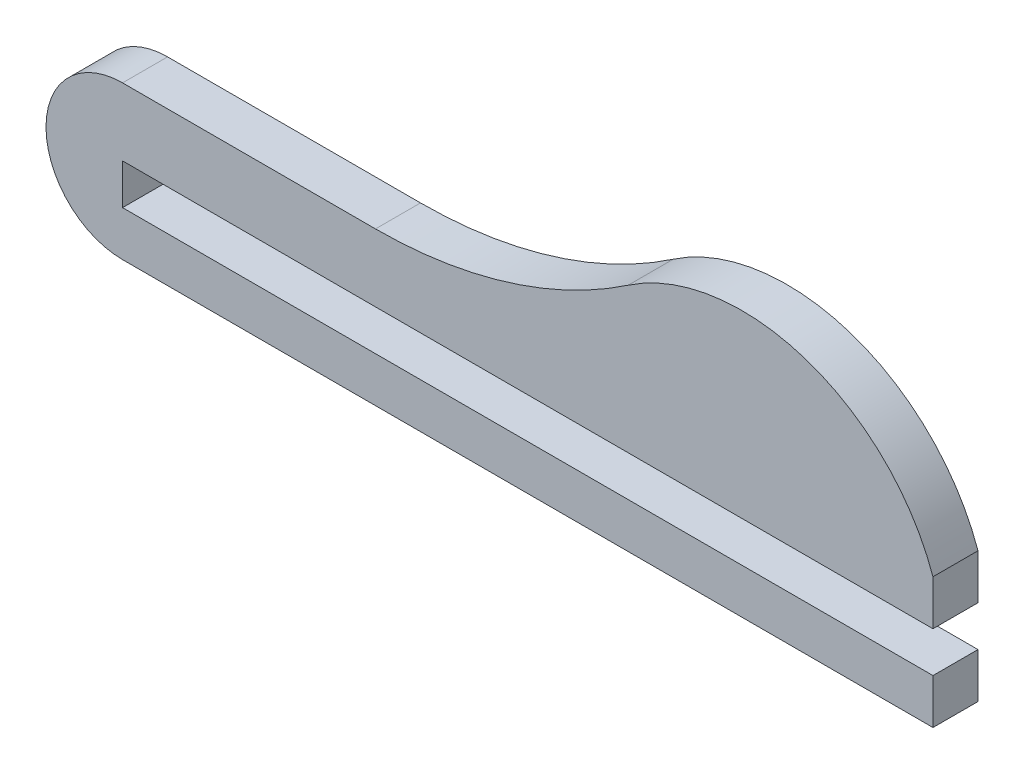
ISO-10303-21;
HEADER;
FILE_DESCRIPTION(('STEP AP214'),'2;1');
FILE_NAME('part.step','',(''),(''),'','','');
FILE_SCHEMA(('AUTOMOTIVE_DESIGN { 1 0 10303 214 1 1 1 1 }'));
ENDSEC;
DATA;
#1=APPLICATION_CONTEXT('core data for automotive mechanical design processes');
#2=APPLICATION_PROTOCOL_DEFINITION('international standard','automotive_design',2000,#1);
#3=PRODUCT_CONTEXT('',#1,'mechanical');
#4=PRODUCT('Part','Part','',(#3));
#5=PRODUCT_RELATED_PRODUCT_CATEGORY('part','',(#4));
#6=PRODUCT_DEFINITION_FORMATION('','',#4);
#7=PRODUCT_DEFINITION_CONTEXT('part definition',#1,'design');
#8=PRODUCT_DEFINITION('design','',#6,#7);
#9=PRODUCT_DEFINITION_SHAPE('','',#8);
#10=(LENGTH_UNIT() NAMED_UNIT(*) SI_UNIT(.MILLI.,.METRE.));
#11=(NAMED_UNIT(*) PLANE_ANGLE_UNIT() SI_UNIT($,.RADIAN.));
#12=(NAMED_UNIT(*) SI_UNIT($,.STERADIAN.) SOLID_ANGLE_UNIT());
#13=UNCERTAINTY_MEASURE_WITH_UNIT(LENGTH_MEASURE(1.E-05),#10,'distance_accuracy_value','');
#14=(GEOMETRIC_REPRESENTATION_CONTEXT(3) GLOBAL_UNCERTAINTY_ASSIGNED_CONTEXT((#13)) GLOBAL_UNIT_ASSIGNED_CONTEXT((#10,
#11,#12)) REPRESENTATION_CONTEXT('',''));
#15=CARTESIAN_POINT('',(0.,0.,0.));
#16=DIRECTION('',(0.,0.,1.));
#17=DIRECTION('',(1.,0.,0.));
#18=AXIS2_PLACEMENT_3D('',#15,#16,#17);
#19=CARTESIAN_POINT('',(36.,2.,2.));
#20=DIRECTION('',(-1.,0.,0.));
#21=DIRECTION('',(0.,0.,1.));
#22=AXIS2_PLACEMENT_3D('',#19,#20,#21);
#23=PLANE('',#22);
#24=DIRECTION('',(0.,1.,0.));
#25=VECTOR('',#24,1.);
#26=CARTESIAN_POINT('',(36.,2.,0.));
#27=LINE('',#26,#25);
#28=CARTESIAN_POINT('',(36.,0.,0.));
#29=VERTEX_POINT('',#28);
#30=CARTESIAN_POINT('',(36.,2.,0.));
#31=VERTEX_POINT('',#30);
#32=EDGE_CURVE('E152',#29,#31,#27,.T.);
#33=ORIENTED_EDGE('',*,*,#32,.T.);
#34=DIRECTION('',(0.,0.,-1.));
#35=VECTOR('',#34,1.);
#36=CARTESIAN_POINT('',(36.,2.,2.));
#37=LINE('',#36,#35);
#38=CARTESIAN_POINT('',(36.,2.,2.));
#39=VERTEX_POINT('',#38);
#40=EDGE_CURVE('E11',#39,#31,#37,.T.);
#41=ORIENTED_EDGE('',*,*,#40,.F.);
#42=DIRECTION('',(0.,1.,0.));
#43=VECTOR('',#42,1.);
#44=CARTESIAN_POINT('',(36.,2.,2.));
#45=LINE('',#44,#43);
#46=CARTESIAN_POINT('',(36.,0.,2.));
#47=VERTEX_POINT('',#46);
#48=EDGE_CURVE('E180',#47,#39,#45,.T.);
#49=ORIENTED_EDGE('',*,*,#48,.F.);
#50=DIRECTION('',(0.,0.,-1.));
#51=VECTOR('',#50,1.);
#52=CARTESIAN_POINT('',(36.,0.,2.));
#53=LINE('',#52,#51);
#54=EDGE_CURVE('E148',#47,#29,#53,.T.);
#55=ORIENTED_EDGE('',*,*,#54,.T.);
#56=EDGE_LOOP('',(#33,#41,#49,#55));
#57=FACE_BOUND('',#56,.T.);
#58=ADVANCED_FACE('F39',(#57),#23,.F.);
#59=CARTESIAN_POINT('',(27.5147186257614,-1.,2.));
#60=DIRECTION('',(0.,0.,-1.));
#61=DIRECTION('',(-1.,0.,0.));
#62=AXIS2_PLACEMENT_3D('',#59,#60,#61);
#63=CYLINDRICAL_SURFACE('',#62,9.);
#64=CARTESIAN_POINT('',(27.5147186257614,-1.,0.));
#65=DIRECTION('',(0.,0.,1.));
#66=DIRECTION('',(-1.,0.,0.));
#67=AXIS2_PLACEMENT_3D('',#64,#65,#66);
#68=CIRCLE('',#67,9.);
#69=CARTESIAN_POINT('',(22.4626708545581,6.44827586206895,0.));
#70=VERTEX_POINT('',#69);
#71=EDGE_CURVE('E156',#31,#70,#68,.T.);
#72=ORIENTED_EDGE('',*,*,#71,.T.);
#73=DIRECTION('',(0.,0.,-1.));
#74=VECTOR('',#73,1.);
#75=CARTESIAN_POINT('',(22.4626708545581,6.44827586206895,2.));
#76=LINE('',#75,#74);
#77=CARTESIAN_POINT('',(22.4626708545581,6.44827586206895,2.));
#78=VERTEX_POINT('',#77);
#79=EDGE_CURVE('E48',#78,#70,#76,.T.);
#80=ORIENTED_EDGE('',*,*,#79,.F.);
#81=CARTESIAN_POINT('',(27.5147186257614,-1.,2.));
#82=DIRECTION('',(0.,0.,1.));
#83=DIRECTION('',(-1.,0.,0.));
#84=AXIS2_PLACEMENT_3D('',#81,#82,#83);
#85=CIRCLE('',#84,9.);
#86=EDGE_CURVE('E105',#39,#78,#85,.T.);
#87=ORIENTED_EDGE('',*,*,#86,.F.);
#88=ORIENTED_EDGE('',*,*,#40,.T.);
#89=EDGE_LOOP('',(#72,#80,#87,#88));
#90=FACE_BOUND('',#89,.T.);
#91=ADVANCED_FACE('F244',(#90),#63,.T.);
#92=CARTESIAN_POINT('',(11.2358980296617,23.,2.));
#93=DIRECTION('',(0.,0.,-1.));
#94=DIRECTION('',(-1.,0.,0.));
#95=AXIS2_PLACEMENT_3D('',#92,#93,#94);
#96=CYLINDRICAL_SURFACE('',#95,20.);
#97=CARTESIAN_POINT('',(11.2358980296617,23.,0.));
#98=DIRECTION('',(0.,0.,-1.));
#99=DIRECTION('',(1.,0.,0.));
#100=AXIS2_PLACEMENT_3D('',#97,#98,#99);
#101=CIRCLE('',#100,20.);
#102=CARTESIAN_POINT('',(11.2358980296617,3.,0.));
#103=VERTEX_POINT('',#102);
#104=EDGE_CURVE('E159',#70,#103,#101,.T.);
#105=ORIENTED_EDGE('',*,*,#104,.T.);
#106=DIRECTION('',(0.,0.,-1.));
#107=VECTOR('',#106,1.);
#108=CARTESIAN_POINT('',(11.2358980296617,3.,2.));
#109=LINE('',#108,#107);
#110=CARTESIAN_POINT('',(11.2358980296617,3.,2.));
#111=VERTEX_POINT('',#110);
#112=EDGE_CURVE('E199',#111,#103,#109,.T.);
#113=ORIENTED_EDGE('',*,*,#112,.F.);
#114=CARTESIAN_POINT('',(11.2358980296617,23.,2.));
#115=DIRECTION('',(0.,0.,-1.));
#116=DIRECTION('',(1.,0.,0.));
#117=AXIS2_PLACEMENT_3D('',#114,#115,#116);
#118=CIRCLE('',#117,20.);
#119=EDGE_CURVE('E209',#78,#111,#118,.T.);
#120=ORIENTED_EDGE('',*,*,#119,.F.);
#121=ORIENTED_EDGE('',*,*,#79,.T.);
#122=EDGE_LOOP('',(#105,#113,#120,#121));
#123=FACE_BOUND('',#122,.T.);
#124=ADVANCED_FACE('F207',(#123),#96,.F.);
#125=CARTESIAN_POINT('',(0.,3.,2.));
#126=DIRECTION('',(0.,-1.,0.));
#127=DIRECTION('',(0.,0.,-1.));
#128=AXIS2_PLACEMENT_3D('',#125,#126,#127);
#129=PLANE('',#128);
#130=DIRECTION('',(-1.,0.,0.));
#131=VECTOR('',#130,1.);
#132=CARTESIAN_POINT('',(0.,3.,0.));
#133=LINE('',#132,#131);
#134=CARTESIAN_POINT('',(0.,3.,0.));
#135=VERTEX_POINT('',#134);
#136=EDGE_CURVE('E162',#103,#135,#133,.T.);
#137=ORIENTED_EDGE('',*,*,#136,.T.);
#138=DIRECTION('',(0.,0.,-1.));
#139=VECTOR('',#138,1.);
#140=CARTESIAN_POINT('',(0.,3.,2.));
#141=LINE('',#140,#139);
#142=CARTESIAN_POINT('',(0.,3.,2.));
#143=VERTEX_POINT('',#142);
#144=EDGE_CURVE('E195',#143,#135,#141,.T.);
#145=ORIENTED_EDGE('',*,*,#144,.F.);
#146=DIRECTION('',(-1.,0.,0.));
#147=VECTOR('',#146,1.);
#148=CARTESIAN_POINT('',(0.,3.,2.));
#149=LINE('',#148,#147);
#150=EDGE_CURVE('E228',#111,#143,#149,.T.);
#151=ORIENTED_EDGE('',*,*,#150,.F.);
#152=ORIENTED_EDGE('',*,*,#112,.T.);
#153=EDGE_LOOP('',(#137,#145,#151,#152));
#154=FACE_BOUND('',#153,.T.);
#155=ADVANCED_FACE('F218',(#154),#129,.F.);
#156=CARTESIAN_POINT('',(0.,-0.400000000000006,2.));
#157=DIRECTION('',(0.,0.,-1.));
#158=DIRECTION('',(-1.,0.,0.));
#159=AXIS2_PLACEMENT_3D('',#156,#157,#158);
#160=CYLINDRICAL_SURFACE('',#159,3.4);
#161=CARTESIAN_POINT('',(0.,-0.400000000000006,0.));
#162=DIRECTION('',(0.,0.,1.));
#163=DIRECTION('',(-1.,0.,0.));
#164=AXIS2_PLACEMENT_3D('',#161,#162,#163);
#165=CIRCLE('',#164,3.4);
#166=CARTESIAN_POINT('',(0.,-3.80000000000001,0.));
#167=VERTEX_POINT('',#166);
#168=EDGE_CURVE('E165',#135,#167,#165,.T.);
#169=ORIENTED_EDGE('',*,*,#168,.T.);
#170=DIRECTION('',(0.,0.,-1.));
#171=VECTOR('',#170,1.);
#172=CARTESIAN_POINT('',(0.,-3.80000000000001,2.));
#173=LINE('',#172,#171);
#174=CARTESIAN_POINT('',(0.,-3.80000000000001,2.));
#175=VERTEX_POINT('',#174);
#176=EDGE_CURVE('E191',#175,#167,#173,.T.);
#177=ORIENTED_EDGE('',*,*,#176,.F.);
#178=CARTESIAN_POINT('',(0.,-0.400000000000006,2.));
#179=DIRECTION('',(0.,0.,1.));
#180=DIRECTION('',(-1.,0.,0.));
#181=AXIS2_PLACEMENT_3D('',#178,#179,#180);
#182=CIRCLE('',#181,3.4);
#183=EDGE_CURVE('E224',#143,#175,#182,.T.);
#184=ORIENTED_EDGE('',*,*,#183,.F.);
#185=ORIENTED_EDGE('',*,*,#144,.T.);
#186=EDGE_LOOP('',(#169,#177,#184,#185));
#187=FACE_BOUND('',#186,.T.);
#188=ADVANCED_FACE('F222',(#187),#160,.T.);
#189=CARTESIAN_POINT('',(36.,-3.8,2.));
#190=DIRECTION('',(0.,1.,0.));
#191=DIRECTION('',(-1.,0.,0.));
#192=AXIS2_PLACEMENT_3D('',#189,#190,#191);
#193=PLANE('',#192);
#194=DIRECTION('',(1.,0.,0.));
#195=VECTOR('',#194,1.);
#196=CARTESIAN_POINT('',(36.,-3.8,0.));
#197=LINE('',#196,#195);
#198=CARTESIAN_POINT('',(36.,-3.8,0.));
#199=VERTEX_POINT('',#198);
#200=EDGE_CURVE('E168',#167,#199,#197,.T.);
#201=ORIENTED_EDGE('',*,*,#200,.T.);
#202=DIRECTION('',(0.,0.,-1.));
#203=VECTOR('',#202,1.);
#204=CARTESIAN_POINT('',(36.,-3.8,2.));
#205=LINE('',#204,#203);
#206=CARTESIAN_POINT('',(36.,-3.8,2.));
#207=VERTEX_POINT('',#206);
#208=EDGE_CURVE('E187',#207,#199,#205,.T.);
#209=ORIENTED_EDGE('',*,*,#208,.F.);
#210=DIRECTION('',(1.,0.,0.));
#211=VECTOR('',#210,1.);
#212=CARTESIAN_POINT('',(36.,-3.8,2.));
#213=LINE('',#212,#211);
#214=EDGE_CURVE('E227',#175,#207,#213,.T.);
#215=ORIENTED_EDGE('',*,*,#214,.F.);
#216=ORIENTED_EDGE('',*,*,#176,.T.);
#217=EDGE_LOOP('',(#201,#209,#215,#216));
#218=FACE_BOUND('',#217,.T.);
#219=ADVANCED_FACE('F256',(#218),#193,.F.);
#220=CARTESIAN_POINT('',(36.,-1.8,2.));
#221=DIRECTION('',(-1.,0.,0.));
#222=DIRECTION('',(0.,0.,1.));
#223=AXIS2_PLACEMENT_3D('',#220,#221,#222);
#224=PLANE('',#223);
#225=DIRECTION('',(0.,1.,0.));
#226=VECTOR('',#225,1.);
#227=CARTESIAN_POINT('',(36.,-1.8,0.));
#228=LINE('',#227,#226);
#229=CARTESIAN_POINT('',(36.,-1.8,0.));
#230=VERTEX_POINT('',#229);
#231=EDGE_CURVE('E171',#199,#230,#228,.T.);
#232=ORIENTED_EDGE('',*,*,#231,.T.);
#233=DIRECTION('',(0.,0.,-1.));
#234=VECTOR('',#233,1.);
#235=CARTESIAN_POINT('',(36.,-1.8,2.));
#236=LINE('',#235,#234);
#237=CARTESIAN_POINT('',(36.,-1.8,2.));
#238=VERTEX_POINT('',#237);
#239=EDGE_CURVE('E141',#238,#230,#236,.T.);
#240=ORIENTED_EDGE('',*,*,#239,.F.);
#241=DIRECTION('',(0.,1.,0.));
#242=VECTOR('',#241,1.);
#243=CARTESIAN_POINT('',(36.,-1.8,2.));
#244=LINE('',#243,#242);
#245=EDGE_CURVE('E130',#207,#238,#244,.T.);
#246=ORIENTED_EDGE('',*,*,#245,.F.);
#247=ORIENTED_EDGE('',*,*,#208,.T.);
#248=EDGE_LOOP('',(#232,#240,#246,#247));
#249=FACE_BOUND('',#248,.T.);
#250=ADVANCED_FACE('F259',(#249),#224,.F.);
#251=CARTESIAN_POINT('',(0.,-1.8,2.));
#252=DIRECTION('',(0.,-1.,0.));
#253=DIRECTION('',(0.,0.,-1.));
#254=AXIS2_PLACEMENT_3D('',#251,#252,#253);
#255=PLANE('',#254);
#256=DIRECTION('',(-1.,0.,0.));
#257=VECTOR('',#256,1.);
#258=CARTESIAN_POINT('',(0.,-1.8,0.));
#259=LINE('',#258,#257);
#260=CARTESIAN_POINT('',(0.,-1.8,0.));
#261=VERTEX_POINT('',#260);
#262=EDGE_CURVE('E139',#230,#261,#259,.T.);
#263=ORIENTED_EDGE('',*,*,#262,.T.);
#264=DIRECTION('',(0.,0.,-1.));
#265=VECTOR('',#264,1.);
#266=CARTESIAN_POINT('',(0.,-1.8,2.));
#267=LINE('',#266,#265);
#268=CARTESIAN_POINT('',(0.,-1.8,2.));
#269=VERTEX_POINT('',#268);
#270=EDGE_CURVE('E136',#269,#261,#267,.T.);
#271=ORIENTED_EDGE('',*,*,#270,.F.);
#272=DIRECTION('',(-1.,0.,0.));
#273=VECTOR('',#272,1.);
#274=CARTESIAN_POINT('',(0.,-1.8,2.));
#275=LINE('',#274,#273);
#276=EDGE_CURVE('E124',#238,#269,#275,.T.);
#277=ORIENTED_EDGE('',*,*,#276,.F.);
#278=ORIENTED_EDGE('',*,*,#239,.T.);
#279=EDGE_LOOP('',(#263,#271,#277,#278));
#280=FACE_BOUND('',#279,.T.);
#281=ADVANCED_FACE('F137',(#280),#255,.F.);
#282=CARTESIAN_POINT('',(0.,0.,2.));
#283=DIRECTION('',(-1.,0.,0.));
#284=DIRECTION('',(0.,-1.,0.));
#285=AXIS2_PLACEMENT_3D('',#282,#283,#284);
#286=PLANE('',#285);
#287=DIRECTION('',(0.,1.,0.));
#288=VECTOR('',#287,1.);
#289=CARTESIAN_POINT('',(0.,0.,0.));
#290=LINE('',#289,#288);
#291=CARTESIAN_POINT('',(0.,0.,0.));
#292=VERTEX_POINT('',#291);
#293=EDGE_CURVE('E91',#261,#292,#290,.T.);
#294=ORIENTED_EDGE('',*,*,#293,.T.);
#295=DIRECTION('',(0.,0.,-1.));
#296=VECTOR('',#295,1.);
#297=CARTESIAN_POINT('',(0.,0.,2.));
#298=LINE('',#297,#296);
#299=CARTESIAN_POINT('',(0.,0.,2.));
#300=VERTEX_POINT('',#299);
#301=EDGE_CURVE('E142',#300,#292,#298,.T.);
#302=ORIENTED_EDGE('',*,*,#301,.F.);
#303=DIRECTION('',(0.,1.,0.));
#304=VECTOR('',#303,1.);
#305=CARTESIAN_POINT('',(0.,0.,2.));
#306=LINE('',#305,#304);
#307=EDGE_CURVE('E128',#269,#300,#306,.T.);
#308=ORIENTED_EDGE('',*,*,#307,.F.);
#309=ORIENTED_EDGE('',*,*,#270,.T.);
#310=EDGE_LOOP('',(#294,#302,#308,#309));
#311=FACE_BOUND('',#310,.T.);
#312=ADVANCED_FACE('F144',(#311),#286,.F.);
#313=CARTESIAN_POINT('',(36.,0.,2.));
#314=DIRECTION('',(0.,1.,0.));
#315=DIRECTION('',(-1.,0.,0.));
#316=AXIS2_PLACEMENT_3D('',#313,#314,#315);
#317=PLANE('',#316);
#318=DIRECTION('',(1.,0.,0.));
#319=VECTOR('',#318,1.);
#320=CARTESIAN_POINT('',(36.,0.,0.));
#321=LINE('',#320,#319);
#322=EDGE_CURVE('E97',#292,#29,#321,.T.);
#323=ORIENTED_EDGE('',*,*,#322,.T.);
#324=ORIENTED_EDGE('',*,*,#54,.F.);
#325=DIRECTION('',(1.,0.,0.));
#326=VECTOR('',#325,1.);
#327=CARTESIAN_POINT('',(36.,0.,2.));
#328=LINE('',#327,#326);
#329=EDGE_CURVE('E56',#300,#47,#328,.T.);
#330=ORIENTED_EDGE('',*,*,#329,.F.);
#331=ORIENTED_EDGE('',*,*,#301,.T.);
#332=EDGE_LOOP('',(#323,#324,#330,#331));
#333=FACE_BOUND('',#332,.T.);
#334=ADVANCED_FACE('F268',(#333),#317,.F.);
#335=CARTESIAN_POINT('',(0.,-0.400000000000006,2.));
#336=DIRECTION('',(0.,0.,-1.));
#337=DIRECTION('',(-1.,0.,0.));
#338=AXIS2_PLACEMENT_3D('',#335,#336,#337);
#339=PLANE('',#338);
#340=ORIENTED_EDGE('',*,*,#48,.T.);
#341=ORIENTED_EDGE('',*,*,#86,.T.);
#342=ORIENTED_EDGE('',*,*,#119,.T.);
#343=ORIENTED_EDGE('',*,*,#150,.T.);
#344=ORIENTED_EDGE('',*,*,#183,.T.);
#345=ORIENTED_EDGE('',*,*,#214,.T.);
#346=ORIENTED_EDGE('',*,*,#245,.T.);
#347=ORIENTED_EDGE('',*,*,#276,.T.);
#348=ORIENTED_EDGE('',*,*,#307,.T.);
#349=ORIENTED_EDGE('',*,*,#329,.T.);
#350=EDGE_LOOP('',(#340,#341,#342,#343,#344,#345,#346,#347,#348,#349));
#351=FACE_BOUND('',#350,.T.);
#352=ADVANCED_FACE('F126',(#351),#339,.F.);
#353=CARTESIAN_POINT('',(0.,-0.400000000000006,0.));
#354=DIRECTION('',(0.,0.,-1.));
#355=DIRECTION('',(-1.,0.,0.));
#356=AXIS2_PLACEMENT_3D('',#353,#354,#355);
#357=PLANE('',#356);
#358=ORIENTED_EDGE('',*,*,#32,.F.);
#359=ORIENTED_EDGE('',*,*,#322,.F.);
#360=ORIENTED_EDGE('',*,*,#293,.F.);
#361=ORIENTED_EDGE('',*,*,#262,.F.);
#362=ORIENTED_EDGE('',*,*,#231,.F.);
#363=ORIENTED_EDGE('',*,*,#200,.F.);
#364=ORIENTED_EDGE('',*,*,#168,.F.);
#365=ORIENTED_EDGE('',*,*,#136,.F.);
#366=ORIENTED_EDGE('',*,*,#104,.F.);
#367=ORIENTED_EDGE('',*,*,#71,.F.);
#368=EDGE_LOOP('',(#358,#359,#360,#361,#362,#363,#364,#365,#366,#367));
#369=FACE_BOUND('',#368,.T.);
#370=ADVANCED_FACE('F213',(#369),#357,.T.);
#371=CLOSED_SHELL('',(#58,#91,#124,#155,#188,#219,#250,#281,#312,#334,#352,#370));
#372=MANIFOLD_SOLID_BREP('B2',#371);
#373=ADVANCED_BREP_SHAPE_REPRESENTATION('',(#18,#372),#14);
#374=SHAPE_DEFINITION_REPRESENTATION(#9,#373);
ENDSEC;
END-ISO-10303-21;
